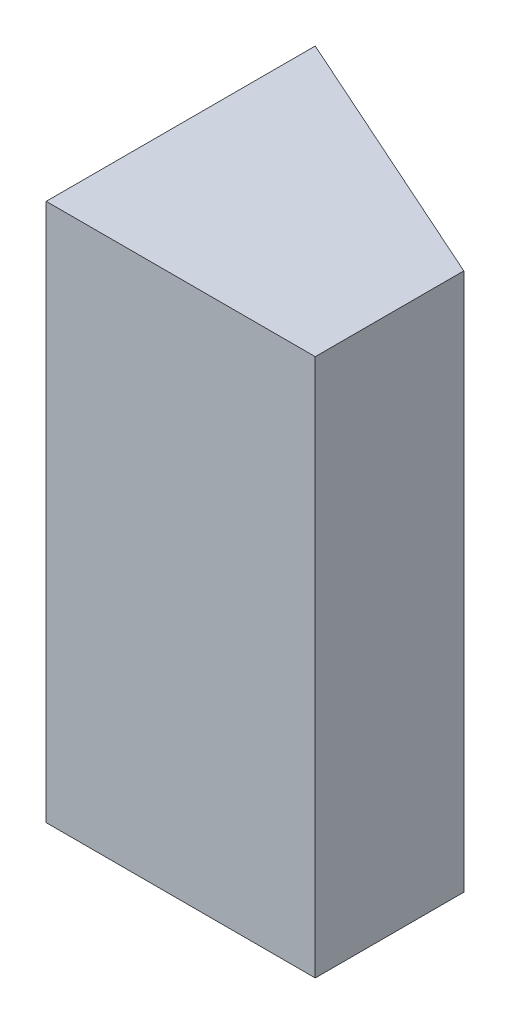
ISO-10303-21;
HEADER;
FILE_DESCRIPTION(('STEP AP214'),'2;1');
FILE_NAME('part.step','',(''),(''),'','','');
FILE_SCHEMA(('AUTOMOTIVE_DESIGN { 1 0 10303 214 1 1 1 1 }'));
ENDSEC;
DATA;
#1=APPLICATION_CONTEXT('core data for automotive mechanical design processes');
#2=APPLICATION_PROTOCOL_DEFINITION('international standard','automotive_design',2000,#1);
#3=PRODUCT_CONTEXT('',#1,'mechanical');
#4=PRODUCT('Part','Part','',(#3));
#5=PRODUCT_RELATED_PRODUCT_CATEGORY('part','',(#4));
#6=PRODUCT_DEFINITION_FORMATION('','',#4);
#7=PRODUCT_DEFINITION_CONTEXT('part definition',#1,'design');
#8=PRODUCT_DEFINITION('design','',#6,#7);
#9=PRODUCT_DEFINITION_SHAPE('','',#8);
#10=(LENGTH_UNIT() NAMED_UNIT(*) SI_UNIT(.MILLI.,.METRE.));
#11=(NAMED_UNIT(*) PLANE_ANGLE_UNIT() SI_UNIT($,.RADIAN.));
#12=(NAMED_UNIT(*) SI_UNIT($,.STERADIAN.) SOLID_ANGLE_UNIT());
#13=UNCERTAINTY_MEASURE_WITH_UNIT(LENGTH_MEASURE(1.E-05),#10,'distance_accuracy_value','');
#14=(GEOMETRIC_REPRESENTATION_CONTEXT(3) GLOBAL_UNCERTAINTY_ASSIGNED_CONTEXT((#13)) GLOBAL_UNIT_ASSIGNED_CONTEXT((#10,
#11,#12)) REPRESENTATION_CONTEXT('',''));
#15=CARTESIAN_POINT('',(0.,0.,0.));
#16=DIRECTION('',(0.,0.,1.));
#17=DIRECTION('',(1.,0.,0.));
#18=AXIS2_PLACEMENT_3D('',#15,#16,#17);
#19=CARTESIAN_POINT('',(-51.374196062884,10.01,-7.60192675795078));
#20=DIRECTION('',(0.408711157303925,0.,-0.912663787982894));
#21=DIRECTION('',(-0.912663787982894,0.,-0.408711157303925));
#22=AXIS2_PLACEMENT_3D('',#19,#20,#21);
#23=PLANE('',#22);
#24=DIRECTION('',(-0.912663787982894,0.,-0.408711157303925));
#25=VECTOR('',#24,1.);
#26=CARTESIAN_POINT('',(-5.74615347938707,10.,12.8313262486464));
#27=LINE('',#26,#25);
#28=CARTESIAN_POINT('',(-41.374196062884,10.,-3.12370418918611));
#29=VERTEX_POINT('',#28);
#30=CARTESIAN_POINT('',(-51.374196062884,10.,-7.60192675795078));
#31=VERTEX_POINT('',#30);
#32=EDGE_CURVE('E88',#29,#31,#27,.T.);
#33=ORIENTED_EDGE('',*,*,#32,.F.);
#34=DIRECTION('',(0.,1.,0.));
#35=VECTOR('',#34,1.);
#36=CARTESIAN_POINT('',(-41.374196062884,-10.,-3.12370418918611));
#37=LINE('',#36,#35);
#38=CARTESIAN_POINT('',(-41.374196062884,-10.,-3.12370418918611));
#39=VERTEX_POINT('',#38);
#40=EDGE_CURVE('E92',#39,#29,#37,.T.);
#41=ORIENTED_EDGE('',*,*,#40,.F.);
#42=DIRECTION('',(-0.912663787982894,0.,-0.408711157303925));
#43=VECTOR('',#42,1.);
#44=CARTESIAN_POINT('',(-5.74615347938707,-10.,12.8313262486464));
#45=LINE('',#44,#43);
#46=CARTESIAN_POINT('',(-51.374196062884,-10.,-7.60192675795078));
#47=VERTEX_POINT('',#46);
#48=EDGE_CURVE('E93',#39,#47,#45,.T.);
#49=ORIENTED_EDGE('',*,*,#48,.T.);
#50=DIRECTION('',(0.,1.,0.));
#51=VECTOR('',#50,1.);
#52=CARTESIAN_POINT('',(-51.374196062884,-10.,-7.60192675795078));
#53=LINE('',#52,#51);
#54=EDGE_CURVE('E44',#47,#31,#53,.T.);
#55=ORIENTED_EDGE('',*,*,#54,.T.);
#56=EDGE_LOOP('',(#33,#41,#49,#55));
#57=FACE_BOUND('',#56,.T.);
#58=ADVANCED_FACE('F40',(#57),#23,.T.);
#59=CARTESIAN_POINT('',(0.,-10.,2.39807324204921));
#60=DIRECTION('',(0.,0.,1.));
#61=DIRECTION('',(1.,0.,0.));
#62=AXIS2_PLACEMENT_3D('',#59,#60,#61);
#63=PLANE('',#62);
#64=DIRECTION('',(0.,1.,0.));
#65=VECTOR('',#64,1.);
#66=CARTESIAN_POINT('',(-41.374196062884,-10.,2.39807324204921));
#67=LINE('',#66,#65);
#68=CARTESIAN_POINT('',(-41.374196062884,-10.,2.39807324204921));
#69=VERTEX_POINT('',#68);
#70=CARTESIAN_POINT('',(-41.374196062884,10.,2.39807324204921));
#71=VERTEX_POINT('',#70);
#72=EDGE_CURVE('E64',#69,#71,#67,.T.);
#73=ORIENTED_EDGE('',*,*,#72,.T.);
#74=DIRECTION('',(1.,0.,0.));
#75=VECTOR('',#74,1.);
#76=CARTESIAN_POINT('',(0.,10.,2.39807324204921));
#77=LINE('',#76,#75);
#78=CARTESIAN_POINT('',(-51.374196062884,10.,2.39807324204921));
#79=VERTEX_POINT('',#78);
#80=EDGE_CURVE('E49',#79,#71,#77,.T.);
#81=ORIENTED_EDGE('',*,*,#80,.F.);
#82=DIRECTION('',(0.,1.,0.));
#83=VECTOR('',#82,1.);
#84=CARTESIAN_POINT('',(-51.374196062884,-10.,2.39807324204921));
#85=LINE('',#84,#83);
#86=CARTESIAN_POINT('',(-51.374196062884,-10.,2.39807324204921));
#87=VERTEX_POINT('',#86);
#88=EDGE_CURVE('E57',#87,#79,#85,.T.);
#89=ORIENTED_EDGE('',*,*,#88,.F.);
#90=DIRECTION('',(1.,0.,0.));
#91=VECTOR('',#90,1.);
#92=CARTESIAN_POINT('',(0.,-10.,2.39807324204921));
#93=LINE('',#92,#91);
#94=EDGE_CURVE('E103',#87,#69,#93,.T.);
#95=ORIENTED_EDGE('',*,*,#94,.T.);
#96=EDGE_LOOP('',(#73,#81,#89,#95));
#97=FACE_BOUND('',#96,.T.);
#98=ADVANCED_FACE('F114',(#97),#63,.T.);
#99=CARTESIAN_POINT('',(-51.374196062884,-10.,0.));
#100=DIRECTION('',(-1.,0.,0.));
#101=DIRECTION('',(0.,0.,1.));
#102=AXIS2_PLACEMENT_3D('',#99,#100,#101);
#103=PLANE('',#102);
#104=ORIENTED_EDGE('',*,*,#88,.T.);
#105=DIRECTION('',(0.,0.,1.));
#106=VECTOR('',#105,1.);
#107=CARTESIAN_POINT('',(-51.374196062884,10.,0.));
#108=LINE('',#107,#106);
#109=EDGE_CURVE('E11',#31,#79,#108,.T.);
#110=ORIENTED_EDGE('',*,*,#109,.F.);
#111=ORIENTED_EDGE('',*,*,#54,.F.);
#112=DIRECTION('',(0.,0.,1.));
#113=VECTOR('',#112,1.);
#114=CARTESIAN_POINT('',(-51.374196062884,-10.,0.));
#115=LINE('',#114,#113);
#116=EDGE_CURVE('E101',#47,#87,#115,.T.);
#117=ORIENTED_EDGE('',*,*,#116,.T.);
#118=EDGE_LOOP('',(#104,#110,#111,#117));
#119=FACE_BOUND('',#118,.T.);
#120=ADVANCED_FACE('F83',(#119),#103,.T.);
#121=CARTESIAN_POINT('',(-41.374196062884,-10.,0.));
#122=DIRECTION('',(-1.,0.,0.));
#123=DIRECTION('',(0.,0.,1.));
#124=AXIS2_PLACEMENT_3D('',#121,#122,#123);
#125=PLANE('',#124);
#126=ORIENTED_EDGE('',*,*,#40,.T.);
#127=DIRECTION('',(0.,0.,1.));
#128=VECTOR('',#127,1.);
#129=CARTESIAN_POINT('',(-41.374196062884,10.,0.));
#130=LINE('',#129,#128);
#131=EDGE_CURVE('E90',#29,#71,#130,.T.);
#132=ORIENTED_EDGE('',*,*,#131,.T.);
#133=ORIENTED_EDGE('',*,*,#72,.F.);
#134=DIRECTION('',(0.,0.,1.));
#135=VECTOR('',#134,1.);
#136=CARTESIAN_POINT('',(-41.374196062884,-10.,0.));
#137=LINE('',#136,#135);
#138=EDGE_CURVE('E105',#39,#69,#137,.T.);
#139=ORIENTED_EDGE('',*,*,#138,.F.);
#140=EDGE_LOOP('',(#126,#132,#133,#139));
#141=FACE_BOUND('',#140,.T.);
#142=ADVANCED_FACE('F113',(#141),#125,.F.);
#143=CARTESIAN_POINT('',(0.,10.,0.));
#144=DIRECTION('',(0.,1.,0.));
#145=DIRECTION('',(0.,0.,1.));
#146=AXIS2_PLACEMENT_3D('',#143,#144,#145);
#147=PLANE('',#146);
#148=ORIENTED_EDGE('',*,*,#131,.F.);
#149=ORIENTED_EDGE('',*,*,#32,.T.);
#150=ORIENTED_EDGE('',*,*,#109,.T.);
#151=ORIENTED_EDGE('',*,*,#80,.T.);
#152=EDGE_LOOP('',(#148,#149,#150,#151));
#153=FACE_BOUND('',#152,.T.);
#154=ADVANCED_FACE('F42',(#153),#147,.T.);
#155=CARTESIAN_POINT('',(0.,-10.,0.));
#156=DIRECTION('',(0.,1.,0.));
#157=DIRECTION('',(0.,0.,1.));
#158=AXIS2_PLACEMENT_3D('',#155,#156,#157);
#159=PLANE('',#158);
#160=ORIENTED_EDGE('',*,*,#48,.F.);
#161=ORIENTED_EDGE('',*,*,#138,.T.);
#162=ORIENTED_EDGE('',*,*,#94,.F.);
#163=ORIENTED_EDGE('',*,*,#116,.F.);
#164=EDGE_LOOP('',(#160,#161,#162,#163));
#165=FACE_BOUND('',#164,.T.);
#166=ADVANCED_FACE('F111',(#165),#159,.F.);
#167=CLOSED_SHELL('',(#58,#98,#120,#142,#154,#166));
#168=MANIFOLD_SOLID_BREP('B2',#167);
#169=ADVANCED_BREP_SHAPE_REPRESENTATION('',(#18,#168),#14);
#170=SHAPE_DEFINITION_REPRESENTATION(#9,#169);
ENDSEC;
END-ISO-10303-21;
